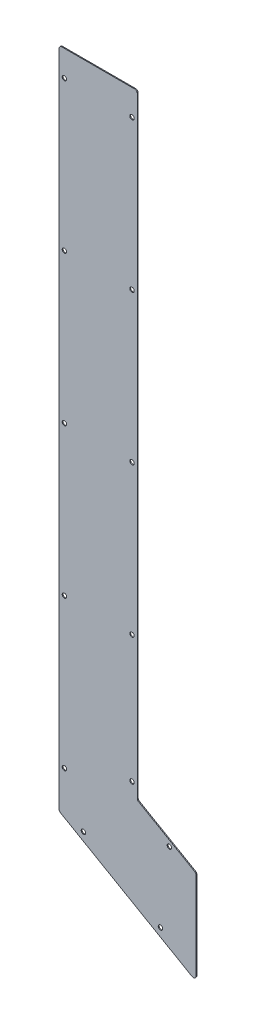
ISO-10303-21;
HEADER;
FILE_DESCRIPTION(('STEP AP214'),'2;1');
FILE_NAME('part.step','',(''),(''),'','','');
FILE_SCHEMA(('AUTOMOTIVE_DESIGN { 1 0 10303 214 1 1 1 1 }'));
ENDSEC;
DATA;
#1=APPLICATION_CONTEXT('core data for automotive mechanical design processes');
#2=APPLICATION_PROTOCOL_DEFINITION('international standard','automotive_design',2000,#1);
#3=PRODUCT_CONTEXT('',#1,'mechanical');
#4=PRODUCT('Part','Part','',(#3));
#5=PRODUCT_RELATED_PRODUCT_CATEGORY('part','',(#4));
#6=PRODUCT_DEFINITION_FORMATION('','',#4);
#7=PRODUCT_DEFINITION_CONTEXT('part definition',#1,'design');
#8=PRODUCT_DEFINITION('design','',#6,#7);
#9=PRODUCT_DEFINITION_SHAPE('','',#8);
#10=(LENGTH_UNIT() NAMED_UNIT(*) SI_UNIT(.MILLI.,.METRE.));
#11=(NAMED_UNIT(*) PLANE_ANGLE_UNIT() SI_UNIT($,.RADIAN.));
#12=(NAMED_UNIT(*) SI_UNIT($,.STERADIAN.) SOLID_ANGLE_UNIT());
#13=UNCERTAINTY_MEASURE_WITH_UNIT(LENGTH_MEASURE(1.E-05),#10,'distance_accuracy_value','');
#14=(GEOMETRIC_REPRESENTATION_CONTEXT(3) GLOBAL_UNCERTAINTY_ASSIGNED_CONTEXT((#13)) GLOBAL_UNIT_ASSIGNED_CONTEXT((#10,
#11,#12)) REPRESENTATION_CONTEXT('',''));
#15=CARTESIAN_POINT('',(0.,0.,0.));
#16=DIRECTION('',(0.,0.,1.));
#17=DIRECTION('',(1.,0.,0.));
#18=AXIS2_PLACEMENT_3D('',#15,#16,#17);
#19=CARTESIAN_POINT('',(104.,161.74,-1.));
#20=DIRECTION('',(1.,0.,0.));
#21=DIRECTION('',(0.,0.,-1.));
#22=AXIS2_PLACEMENT_3D('',#19,#20,#21);
#23=PLANE('',#22);
#24=DIRECTION('',(0.,1.,0.));
#25=VECTOR('',#24,1.);
#26=CARTESIAN_POINT('',(104.,161.74,0.));
#27=LINE('',#26,#25);
#28=CARTESIAN_POINT('',(104.,163.472050807569,0.));
#29=VERTEX_POINT('',#28);
#30=CARTESIAN_POINT('',(104.,850.,0.));
#31=VERTEX_POINT('',#30);
#32=EDGE_CURVE('E202',#29,#31,#27,.T.);
#33=ORIENTED_EDGE('',*,*,#32,.F.);
#34=DIRECTION('',(0.,0.,1.));
#35=VECTOR('',#34,1.);
#36=CARTESIAN_POINT('',(104.,163.472050807569,-1.));
#37=LINE('',#36,#35);
#38=CARTESIAN_POINT('',(104.,163.472050807569,-1.));
#39=VERTEX_POINT('',#38);
#40=EDGE_CURVE('E195',#29,#39,#37,.F.);
#41=ORIENTED_EDGE('',*,*,#40,.T.);
#42=DIRECTION('',(0.,1.,0.));
#43=VECTOR('',#42,1.);
#44=CARTESIAN_POINT('',(104.,161.74,-1.));
#45=LINE('',#44,#43);
#46=CARTESIAN_POINT('',(104.,850.,-1.));
#47=VERTEX_POINT('',#46);
#48=EDGE_CURVE('E219',#39,#47,#45,.T.);
#49=ORIENTED_EDGE('',*,*,#48,.T.);
#50=DIRECTION('',(0.,0.,1.));
#51=VECTOR('',#50,1.);
#52=CARTESIAN_POINT('',(104.,850.,-1.));
#53=LINE('',#52,#51);
#54=EDGE_CURVE('E192',#47,#31,#53,.T.);
#55=ORIENTED_EDGE('',*,*,#54,.T.);
#56=EDGE_LOOP('',(#33,#41,#49,#55));
#57=FACE_BOUND('',#56,.T.);
#58=ADVANCED_FACE('F40',(#57),#23,.T.);
#59=CARTESIAN_POINT('',(104.,161.74,-1.));
#60=DIRECTION('',(0.500000000000004,0.866025403784436,0.));
#61=DIRECTION('',(-0.866025403784436,0.500000000000004,0.));
#62=AXIS2_PLACEMENT_3D('',#59,#60,#61);
#63=PLANE('',#62);
#64=DIRECTION('',(-0.866025403784436,0.500000000000004,0.));
#65=VECTOR('',#64,1.);
#66=CARTESIAN_POINT('',(104.,161.74,-1.));
#67=LINE('',#66,#65);
#68=CARTESIAN_POINT('',(168.5,124.500907637269,-1.));
#69=VERTEX_POINT('',#68);
#70=CARTESIAN_POINT('',(105.5,160.873974596216,-1.));
#71=VERTEX_POINT('',#70);
#72=EDGE_CURVE('E152',#69,#71,#67,.T.);
#73=ORIENTED_EDGE('',*,*,#72,.T.);
#74=DIRECTION('',(0.,0.,1.));
#75=VECTOR('',#74,1.);
#76=CARTESIAN_POINT('',(105.5,160.873974596216,0.));
#77=LINE('',#76,#75);
#78=CARTESIAN_POINT('',(105.5,160.873974596216,0.));
#79=VERTEX_POINT('',#78);
#80=EDGE_CURVE('E189',#71,#79,#77,.T.);
#81=ORIENTED_EDGE('',*,*,#80,.T.);
#82=DIRECTION('',(-0.866025403784436,0.500000000000004,0.));
#83=VECTOR('',#82,1.);
#84=CARTESIAN_POINT('',(104.,161.74,0.));
#85=LINE('',#84,#83);
#86=CARTESIAN_POINT('',(168.5,124.500907637269,0.));
#87=VERTEX_POINT('',#86);
#88=EDGE_CURVE('E204',#87,#79,#85,.T.);
#89=ORIENTED_EDGE('',*,*,#88,.F.);
#90=DIRECTION('',(0.,0.,1.));
#91=VECTOR('',#90,1.);
#92=CARTESIAN_POINT('',(168.5,124.500907637269,-1.));
#93=LINE('',#92,#91);
#94=EDGE_CURVE('E187',#87,#69,#93,.F.);
#95=ORIENTED_EDGE('',*,*,#94,.T.);
#96=EDGE_LOOP('',(#73,#81,#89,#95));
#97=FACE_BOUND('',#96,.T.);
#98=ADVANCED_FACE('F221',(#97),#63,.T.);
#99=CARTESIAN_POINT('',(170.,123.634882233484,-1.));
#100=DIRECTION('',(1.,0.,0.));
#101=DIRECTION('',(0.,0.,-1.));
#102=AXIS2_PLACEMENT_3D('',#99,#100,#101);
#103=PLANE('',#102);
#104=DIRECTION('',(0.,1.,0.));
#105=VECTOR('',#104,1.);
#106=CARTESIAN_POINT('',(170.,123.634882233484,0.));
#107=LINE('',#106,#105);
#108=CARTESIAN_POINT('',(170.,23.4361524227066,0.));
#109=VERTEX_POINT('',#108);
#110=CARTESIAN_POINT('',(170.,121.902831425915,0.));
#111=VERTEX_POINT('',#110);
#112=EDGE_CURVE('E244',#109,#111,#107,.T.);
#113=ORIENTED_EDGE('',*,*,#112,.F.);
#114=DIRECTION('',(0.,0.,1.));
#115=VECTOR('',#114,1.);
#116=CARTESIAN_POINT('',(170.,23.4361524227066,-1.));
#117=LINE('',#116,#115);
#118=CARTESIAN_POINT('',(170.,23.4361524227066,-1.));
#119=VERTEX_POINT('',#118);
#120=EDGE_CURVE('E185',#109,#119,#117,.F.);
#121=ORIENTED_EDGE('',*,*,#120,.T.);
#122=DIRECTION('',(0.,1.,0.));
#123=VECTOR('',#122,1.);
#124=CARTESIAN_POINT('',(170.,123.634882233484,-1.));
#125=LINE('',#124,#123);
#126=CARTESIAN_POINT('',(170.,121.902831425915,-1.));
#127=VERTEX_POINT('',#126);
#128=EDGE_CURVE('E156',#119,#127,#125,.T.);
#129=ORIENTED_EDGE('',*,*,#128,.T.);
#130=DIRECTION('',(0.,0.,1.));
#131=VECTOR('',#130,1.);
#132=CARTESIAN_POINT('',(170.,121.902831425915,-1.));
#133=LINE('',#132,#131);
#134=EDGE_CURVE('E182',#127,#111,#133,.T.);
#135=ORIENTED_EDGE('',*,*,#134,.T.);
#136=EDGE_LOOP('',(#113,#121,#129,#135));
#137=FACE_BOUND('',#136,.T.);
#138=ADVANCED_FACE('F231',(#137),#103,.T.);
#139=CARTESIAN_POINT('',(170.,18.2399999999999,-1.));
#140=DIRECTION('',(-0.500000000000004,-0.866025403784436,0.));
#141=DIRECTION('',(0.866025403784436,-0.500000000000004,0.));
#142=AXIS2_PLACEMENT_3D('',#139,#140,#141);
#143=PLANE('',#142);
#144=DIRECTION('',(0.866025403784436,-0.500000000000004,0.));
#145=VECTOR('',#144,1.);
#146=CARTESIAN_POINT('',(170.,18.2399999999999,0.));
#147=LINE('',#146,#145);
#148=CARTESIAN_POINT('',(17.5000000000001,106.285916051419,0.));
#149=VERTEX_POINT('',#148);
#150=CARTESIAN_POINT('',(165.5,20.8380762113533,0.));
#151=VERTEX_POINT('',#150);
#152=EDGE_CURVE('E149',#149,#151,#147,.T.);
#153=ORIENTED_EDGE('',*,*,#152,.F.);
#154=DIRECTION('',(0.,0.,1.));
#155=VECTOR('',#154,1.);
#156=CARTESIAN_POINT('',(17.5000000000001,106.285916051419,-1.));
#157=LINE('',#156,#155);
#158=CARTESIAN_POINT('',(17.5000000000001,106.285916051419,-1.));
#159=VERTEX_POINT('',#158);
#160=EDGE_CURVE('E171',#149,#159,#157,.F.);
#161=ORIENTED_EDGE('',*,*,#160,.T.);
#162=DIRECTION('',(0.866025403784436,-0.500000000000004,0.));
#163=VECTOR('',#162,1.);
#164=CARTESIAN_POINT('',(170.,18.2399999999999,-1.));
#165=LINE('',#164,#163);
#166=CARTESIAN_POINT('',(165.5,20.8380762113533,-1.));
#167=VERTEX_POINT('',#166);
#168=EDGE_CURVE('E234',#159,#167,#165,.T.);
#169=ORIENTED_EDGE('',*,*,#168,.T.);
#170=DIRECTION('',(0.,0.,1.));
#171=VECTOR('',#170,1.);
#172=CARTESIAN_POINT('',(165.5,20.8380762113533,-1.));
#173=LINE('',#172,#171);
#174=EDGE_CURVE('E168',#167,#151,#173,.T.);
#175=ORIENTED_EDGE('',*,*,#174,.T.);
#176=EDGE_LOOP('',(#153,#161,#169,#175));
#177=FACE_BOUND('',#176,.T.);
#178=ADVANCED_FACE('F339',(#177),#143,.T.);
#179=CARTESIAN_POINT('',(16.,853.,-1.));
#180=DIRECTION('',(-1.,0.,0.));
#181=DIRECTION('',(0.,-1.,0.));
#182=AXIS2_PLACEMENT_3D('',#179,#180,#181);
#183=PLANE('',#182);
#184=DIRECTION('',(0.,-1.,0.));
#185=VECTOR('',#184,1.);
#186=CARTESIAN_POINT('',(16.,853.,-1.));
#187=LINE('',#186,#185);
#188=CARTESIAN_POINT('',(16.,850.,-1.));
#189=VERTEX_POINT('',#188);
#190=CARTESIAN_POINT('',(16.0000000000001,108.883992262772,-1.));
#191=VERTEX_POINT('',#190);
#192=EDGE_CURVE('E237',#189,#191,#187,.T.);
#193=ORIENTED_EDGE('',*,*,#192,.T.);
#194=DIRECTION('',(0.,0.,1.));
#195=VECTOR('',#194,1.);
#196=CARTESIAN_POINT('',(16.0000000000001,108.883992262772,-1.));
#197=LINE('',#196,#195);
#198=CARTESIAN_POINT('',(16.0000000000001,108.883992262772,0.));
#199=VERTEX_POINT('',#198);
#200=EDGE_CURVE('E148',#191,#199,#197,.T.);
#201=ORIENTED_EDGE('',*,*,#200,.T.);
#202=DIRECTION('',(0.,-1.,0.));
#203=VECTOR('',#202,1.);
#204=CARTESIAN_POINT('',(16.,853.,0.));
#205=LINE('',#204,#203);
#206=CARTESIAN_POINT('',(16.,850.,0.));
#207=VERTEX_POINT('',#206);
#208=EDGE_CURVE('E133',#207,#199,#205,.T.);
#209=ORIENTED_EDGE('',*,*,#208,.F.);
#210=DIRECTION('',(0.,0.,1.));
#211=VECTOR('',#210,1.);
#212=CARTESIAN_POINT('',(16.,850.,-1.));
#213=LINE('',#212,#211);
#214=EDGE_CURVE('E146',#207,#189,#213,.F.);
#215=ORIENTED_EDGE('',*,*,#214,.T.);
#216=EDGE_LOOP('',(#193,#201,#209,#215));
#217=FACE_BOUND('',#216,.T.);
#218=ADVANCED_FACE('F145',(#217),#183,.T.);
#219=CARTESIAN_POINT('',(104.,853.,-1.));
#220=DIRECTION('',(0.,1.,0.));
#221=DIRECTION('',(0.,0.,1.));
#222=AXIS2_PLACEMENT_3D('',#219,#220,#221);
#223=PLANE('',#222);
#224=DIRECTION('',(-1.,0.,0.));
#225=VECTOR('',#224,1.);
#226=CARTESIAN_POINT('',(104.,853.,-1.));
#227=LINE('',#226,#225);
#228=CARTESIAN_POINT('',(101.,853.,-1.));
#229=VERTEX_POINT('',#228);
#230=CARTESIAN_POINT('',(19.,853.,-1.));
#231=VERTEX_POINT('',#230);
#232=EDGE_CURVE('E332',#229,#231,#227,.T.);
#233=ORIENTED_EDGE('',*,*,#232,.T.);
#234=DIRECTION('',(0.,0.,1.));
#235=VECTOR('',#234,1.);
#236=CARTESIAN_POINT('',(19.,853.,-1.));
#237=LINE('',#236,#235);
#238=CARTESIAN_POINT('',(19.,853.,0.));
#239=VERTEX_POINT('',#238);
#240=EDGE_CURVE('E198',#231,#239,#237,.T.);
#241=ORIENTED_EDGE('',*,*,#240,.T.);
#242=DIRECTION('',(-1.,0.,0.));
#243=VECTOR('',#242,1.);
#244=CARTESIAN_POINT('',(104.,853.,0.));
#245=LINE('',#244,#243);
#246=CARTESIAN_POINT('',(101.,853.,0.));
#247=VERTEX_POINT('',#246);
#248=EDGE_CURVE('E134',#247,#239,#245,.T.);
#249=ORIENTED_EDGE('',*,*,#248,.F.);
#250=DIRECTION('',(0.,0.,1.));
#251=VECTOR('',#250,1.);
#252=CARTESIAN_POINT('',(101.,853.,-1.));
#253=LINE('',#252,#251);
#254=EDGE_CURVE('E62',#247,#229,#253,.F.);
#255=ORIENTED_EDGE('',*,*,#254,.T.);
#256=EDGE_LOOP('',(#233,#241,#249,#255));
#257=FACE_BOUND('',#256,.T.);
#258=ADVANCED_FACE('F358',(#257),#223,.T.);
#259=CARTESIAN_POINT('',(0.,0.,-1.));
#260=DIRECTION('',(0.,0.,1.));
#261=DIRECTION('',(1.,0.,0.));
#262=AXIS2_PLACEMENT_3D('',#259,#260,#261);
#263=PLANE('',#262);
#264=CARTESIAN_POINT('',(21.9999999999822,488.,-1.));
#265=DIRECTION('',(0.,0.,-1.));
#266=DIRECTION('',(-1.,0.,0.));
#267=AXIS2_PLACEMENT_3D('',#264,#265,#266);
#268=CIRCLE('',#267,2.5);
#269=CARTESIAN_POINT('',(19.4999999999822,488.,-1.));
#270=VERTEX_POINT('',#269);
#271=EDGE_CURVE('E420',#270,#270,#268,.T.);
#272=ORIENTED_EDGE('',*,*,#271,.F.);
#273=EDGE_LOOP('',(#272));
#274=FACE_BOUND('',#273,.T.);
#275=CARTESIAN_POINT('',(21.9999999999911,656.,-1.));
#276=DIRECTION('',(0.,0.,-1.));
#277=DIRECTION('',(-1.,0.,0.));
#278=AXIS2_PLACEMENT_3D('',#275,#276,#277);
#279=CIRCLE('',#278,2.5);
#280=CARTESIAN_POINT('',(19.4999999999911,656.,-1.));
#281=VERTEX_POINT('',#280);
#282=EDGE_CURVE('E424',#281,#281,#279,.T.);
#283=ORIENTED_EDGE('',*,*,#282,.F.);
#284=EDGE_LOOP('',(#283));
#285=FACE_BOUND('',#284,.T.);
#286=CARTESIAN_POINT('',(140.,134.564882233484,-1.));
#287=DIRECTION('',(0.,0.,-1.));
#288=DIRECTION('',(-1.,0.,0.));
#289=AXIS2_PLACEMENT_3D('',#286,#287,#288);
#290=CIRCLE('',#289,2.5);
#291=CARTESIAN_POINT('',(137.5,134.564882233484,-1.));
#292=VERTEX_POINT('',#291);
#293=EDGE_CURVE('E439',#292,#292,#290,.T.);
#294=ORIENTED_EDGE('',*,*,#293,.F.);
#295=EDGE_LOOP('',(#294));
#296=FACE_BOUND('',#295,.T.);
#297=CARTESIAN_POINT('',(97.9999999999661,319.999999999996,-1.));
#298=DIRECTION('',(0.,0.,-1.));
#299=DIRECTION('',(-1.,0.,0.));
#300=AXIS2_PLACEMENT_3D('',#297,#298,#299);
#301=CIRCLE('',#300,2.50000000000001);
#302=CARTESIAN_POINT('',(95.4999999999661,319.999999999996,-1.));
#303=VERTEX_POINT('',#302);
#304=EDGE_CURVE('E435',#303,#303,#301,.T.);
#305=ORIENTED_EDGE('',*,*,#304,.F.);
#306=EDGE_LOOP('',(#305));
#307=FACE_BOUND('',#306,.T.);
#308=CARTESIAN_POINT('',(97.9999999999661,177.,-1.));
#309=DIRECTION('',(0.,0.,-1.));
#310=DIRECTION('',(-1.,0.,0.));
#311=AXIS2_PLACEMENT_3D('',#308,#309,#310);
#312=CIRCLE('',#311,2.50000000000001);
#313=CARTESIAN_POINT('',(95.4999999999661,177.,-1.));
#314=VERTEX_POINT('',#313);
#315=EDGE_CURVE('E324',#314,#314,#312,.T.);
#316=ORIENTED_EDGE('',*,*,#315,.F.);
#317=EDGE_LOOP('',(#316));
#318=FACE_BOUND('',#317,.T.);
#319=CARTESIAN_POINT('',(98.,823.999999999995,-1.));
#320=DIRECTION('',(0.,0.,-1.));
#321=DIRECTION('',(-1.,0.,0.));
#322=AXIS2_PLACEMENT_3D('',#319,#320,#321);
#323=CIRCLE('',#322,2.5);
#324=CARTESIAN_POINT('',(95.5,823.999999999995,-1.));
#325=VERTEX_POINT('',#324);
#326=EDGE_CURVE('E327',#325,#325,#323,.T.);
#327=ORIENTED_EDGE('',*,*,#326,.F.);
#328=EDGE_LOOP('',(#327));
#329=FACE_BOUND('',#328,.T.);
#330=CARTESIAN_POINT('',(97.9999999999887,655.999999999995,-1.));
#331=DIRECTION('',(0.,0.,-1.));
#332=DIRECTION('',(-1.,0.,0.));
#333=AXIS2_PLACEMENT_3D('',#330,#331,#332);
#334=CIRCLE('',#333,2.5);
#335=CARTESIAN_POINT('',(95.4999999999887,655.999999999995,-1.));
#336=VERTEX_POINT('',#335);
#337=EDGE_CURVE('E444',#336,#336,#334,.T.);
#338=ORIENTED_EDGE('',*,*,#337,.F.);
#339=EDGE_LOOP('',(#338));
#340=FACE_BOUND('',#339,.T.);
#341=CARTESIAN_POINT('',(97.9999999999774,487.999999999995,-1.));
#342=DIRECTION('',(0.,0.,-1.));
#343=DIRECTION('',(-1.,0.,0.));
#344=AXIS2_PLACEMENT_3D('',#341,#342,#343);
#345=CIRCLE('',#344,2.5);
#346=CARTESIAN_POINT('',(95.4999999999774,487.999999999995,-1.));
#347=VERTEX_POINT('',#346);
#348=EDGE_CURVE('E438',#347,#347,#345,.T.);
#349=ORIENTED_EDGE('',*,*,#348,.F.);
#350=EDGE_LOOP('',(#349));
#351=FACE_BOUND('',#350,.T.);
#352=CARTESIAN_POINT('',(21.9999999999732,320.,-1.));
#353=DIRECTION('',(0.,0.,-1.));
#354=DIRECTION('',(-1.,0.,0.));
#355=AXIS2_PLACEMENT_3D('',#352,#353,#354);
#356=CIRCLE('',#355,2.5);
#357=CARTESIAN_POINT('',(19.4999999999732,320.,-1.));
#358=VERTEX_POINT('',#357);
#359=EDGE_CURVE('E418',#358,#358,#356,.T.);
#360=ORIENTED_EDGE('',*,*,#359,.F.);
#361=EDGE_LOOP('',(#360));
#362=FACE_BOUND('',#361,.T.);
#363=CARTESIAN_POINT('',(21.9999999999548,152.,-1.));
#364=DIRECTION('',(0.,0.,-1.));
#365=DIRECTION('',(-1.,0.,0.));
#366=AXIS2_PLACEMENT_3D('',#363,#364,#365);
#367=CIRCLE('',#366,2.5);
#368=CARTESIAN_POINT('',(19.4999999999548,152.,-1.));
#369=VERTEX_POINT('',#368);
#370=EDGE_CURVE('E421',#369,#369,#367,.T.);
#371=ORIENTED_EDGE('',*,*,#370,.F.);
#372=EDGE_LOOP('',(#371));
#373=FACE_BOUND('',#372,.T.);
#374=CARTESIAN_POINT('',(130.,50.7348822334842,-1.));
#375=DIRECTION('',(0.,0.,-1.));
#376=DIRECTION('',(-1.,0.,0.));
#377=AXIS2_PLACEMENT_3D('',#374,#375,#376);
#378=CIRCLE('',#377,2.5);
#379=CARTESIAN_POINT('',(127.5,50.7348822334842,-1.));
#380=VERTEX_POINT('',#379);
#381=EDGE_CURVE('E427',#380,#380,#378,.T.);
#382=ORIENTED_EDGE('',*,*,#381,.F.);
#383=EDGE_LOOP('',(#382));
#384=FACE_BOUND('',#383,.T.);
#385=CARTESIAN_POINT('',(43.3974596215561,100.734882233484,-1.));
#386=DIRECTION('',(0.,0.,-1.));
#387=DIRECTION('',(-1.,0.,0.));
#388=AXIS2_PLACEMENT_3D('',#385,#386,#387);
#389=CIRCLE('',#388,2.5);
#390=CARTESIAN_POINT('',(40.8974596215561,100.734882233484,-1.));
#391=VERTEX_POINT('',#390);
#392=EDGE_CURVE('E432',#391,#391,#389,.T.);
#393=ORIENTED_EDGE('',*,*,#392,.F.);
#394=EDGE_LOOP('',(#393));
#395=FACE_BOUND('',#394,.T.);
#396=CARTESIAN_POINT('',(22.,824.,-1.));
#397=DIRECTION('',(0.,0.,-1.));
#398=DIRECTION('',(-1.,0.,0.));
#399=AXIS2_PLACEMENT_3D('',#396,#397,#398);
#400=CIRCLE('',#399,2.5);
#401=CARTESIAN_POINT('',(19.5,824.,-1.));
#402=VERTEX_POINT('',#401);
#403=EDGE_CURVE('E251',#402,#402,#400,.T.);
#404=ORIENTED_EDGE('',*,*,#403,.F.);
#405=EDGE_LOOP('',(#404));
#406=FACE_BOUND('',#405,.T.);
#407=ORIENTED_EDGE('',*,*,#168,.F.);
#408=CARTESIAN_POINT('',(19.0000000000001,108.883992262772,-1.));
#409=DIRECTION('',(0.,0.,1.));
#410=DIRECTION('',(1.,0.,0.));
#411=AXIS2_PLACEMENT_3D('',#408,#409,#410);
#412=CIRCLE('',#411,3.);
#413=EDGE_CURVE('E180',#159,#191,#412,.F.);
#414=ORIENTED_EDGE('',*,*,#413,.T.);
#415=ORIENTED_EDGE('',*,*,#192,.F.);
#416=CARTESIAN_POINT('',(19.,850.,-1.));
#417=DIRECTION('',(0.,0.,1.));
#418=DIRECTION('',(1.,0.,0.));
#419=AXIS2_PLACEMENT_3D('',#416,#417,#418);
#420=CIRCLE('',#419,3.);
#421=EDGE_CURVE('E55',#189,#231,#420,.F.);
#422=ORIENTED_EDGE('',*,*,#421,.T.);
#423=ORIENTED_EDGE('',*,*,#232,.F.);
#424=CARTESIAN_POINT('',(101.,850.,-1.));
#425=DIRECTION('',(0.,0.,1.));
#426=DIRECTION('',(1.,0.,0.));
#427=AXIS2_PLACEMENT_3D('',#424,#425,#426);
#428=CIRCLE('',#427,3.);
#429=EDGE_CURVE('E173',#229,#47,#428,.F.);
#430=ORIENTED_EDGE('',*,*,#429,.T.);
#431=ORIENTED_EDGE('',*,*,#48,.F.);
#432=CARTESIAN_POINT('',(107.,163.472050807569,-1.));
#433=DIRECTION('',(0.,0.,1.));
#434=DIRECTION('',(1.,0.,0.));
#435=AXIS2_PLACEMENT_3D('',#432,#433,#434);
#436=CIRCLE('',#435,3.);
#437=EDGE_CURVE('E11',#39,#71,#436,.T.);
#438=ORIENTED_EDGE('',*,*,#437,.T.);
#439=ORIENTED_EDGE('',*,*,#72,.F.);
#440=CARTESIAN_POINT('',(167.,121.902831425915,-1.));
#441=DIRECTION('',(0.,0.,1.));
#442=DIRECTION('',(1.,0.,0.));
#443=AXIS2_PLACEMENT_3D('',#440,#441,#442);
#444=CIRCLE('',#443,3.);
#445=EDGE_CURVE('E176',#69,#127,#444,.F.);
#446=ORIENTED_EDGE('',*,*,#445,.T.);
#447=ORIENTED_EDGE('',*,*,#128,.F.);
#448=CARTESIAN_POINT('',(167.,23.4361524227066,-1.));
#449=DIRECTION('',(0.,0.,1.));
#450=DIRECTION('',(1.,0.,0.));
#451=AXIS2_PLACEMENT_3D('',#448,#449,#450);
#452=CIRCLE('',#451,3.);
#453=EDGE_CURVE('E178',#119,#167,#452,.F.);
#454=ORIENTED_EDGE('',*,*,#453,.T.);
#455=EDGE_LOOP('',(#407,#414,#415,#422,#423,#430,#431,#438,#439,#446,#447,#454));
#456=FACE_BOUND('',#455,.T.);
#457=ADVANCED_FACE('F217',(#274,#285,#296,#307,#318,#329,#340,#351,#362,#373,#384,#395,#406,
#456),#263,.F.);
#458=CARTESIAN_POINT('',(0.,0.,0.));
#459=DIRECTION('',(0.,0.,1.));
#460=DIRECTION('',(1.,0.,0.));
#461=AXIS2_PLACEMENT_3D('',#458,#459,#460);
#462=PLANE('',#461);
#463=CARTESIAN_POINT('',(21.9999999999822,488.,0.));
#464=DIRECTION('',(0.,0.,1.));
#465=DIRECTION('',(1.,0.,0.));
#466=AXIS2_PLACEMENT_3D('',#463,#464,#465);
#467=CIRCLE('',#466,2.5);
#468=CARTESIAN_POINT('',(24.4999999999822,488.,0.));
#469=VERTEX_POINT('',#468);
#470=EDGE_CURVE('E159',#469,#469,#467,.T.);
#471=ORIENTED_EDGE('',*,*,#470,.F.);
#472=EDGE_LOOP('',(#471));
#473=FACE_BOUND('',#472,.T.);
#474=CARTESIAN_POINT('',(21.9999999999911,656.,0.));
#475=DIRECTION('',(0.,0.,1.));
#476=DIRECTION('',(1.,0.,0.));
#477=AXIS2_PLACEMENT_3D('',#474,#475,#476);
#478=CIRCLE('',#477,2.5);
#479=CARTESIAN_POINT('',(24.4999999999911,656.,0.));
#480=VERTEX_POINT('',#479);
#481=EDGE_CURVE('E280',#480,#480,#478,.T.);
#482=ORIENTED_EDGE('',*,*,#481,.F.);
#483=EDGE_LOOP('',(#482));
#484=FACE_BOUND('',#483,.T.);
#485=CARTESIAN_POINT('',(140.,134.564882233484,0.));
#486=DIRECTION('',(0.,0.,1.));
#487=DIRECTION('',(1.,0.,0.));
#488=AXIS2_PLACEMENT_3D('',#485,#486,#487);
#489=CIRCLE('',#488,2.5);
#490=CARTESIAN_POINT('',(142.5,134.564882233484,0.));
#491=VERTEX_POINT('',#490);
#492=EDGE_CURVE('E278',#491,#491,#489,.T.);
#493=ORIENTED_EDGE('',*,*,#492,.F.);
#494=EDGE_LOOP('',(#493));
#495=FACE_BOUND('',#494,.T.);
#496=CARTESIAN_POINT('',(97.9999999999661,319.999999999996,0.));
#497=DIRECTION('',(0.,0.,1.));
#498=DIRECTION('',(1.,0.,0.));
#499=AXIS2_PLACEMENT_3D('',#496,#497,#498);
#500=CIRCLE('',#499,2.50000000000001);
#501=CARTESIAN_POINT('',(100.499999999966,319.999999999996,0.));
#502=VERTEX_POINT('',#501);
#503=EDGE_CURVE('E275',#502,#502,#500,.T.);
#504=ORIENTED_EDGE('',*,*,#503,.F.);
#505=EDGE_LOOP('',(#504));
#506=FACE_BOUND('',#505,.T.);
#507=CARTESIAN_POINT('',(97.9999999999661,177.,0.));
#508=DIRECTION('',(0.,0.,1.));
#509=DIRECTION('',(1.,0.,0.));
#510=AXIS2_PLACEMENT_3D('',#507,#508,#509);
#511=CIRCLE('',#510,2.50000000000001);
#512=CARTESIAN_POINT('',(100.499999999966,177.,0.));
#513=VERTEX_POINT('',#512);
#514=EDGE_CURVE('E272',#513,#513,#511,.T.);
#515=ORIENTED_EDGE('',*,*,#514,.F.);
#516=EDGE_LOOP('',(#515));
#517=FACE_BOUND('',#516,.T.);
#518=CARTESIAN_POINT('',(98.,823.999999999995,0.));
#519=DIRECTION('',(0.,0.,1.));
#520=DIRECTION('',(1.,0.,0.));
#521=AXIS2_PLACEMENT_3D('',#518,#519,#520);
#522=CIRCLE('',#521,2.5);
#523=CARTESIAN_POINT('',(100.5,823.999999999995,0.));
#524=VERTEX_POINT('',#523);
#525=EDGE_CURVE('E269',#524,#524,#522,.T.);
#526=ORIENTED_EDGE('',*,*,#525,.F.);
#527=EDGE_LOOP('',(#526));
#528=FACE_BOUND('',#527,.T.);
#529=CARTESIAN_POINT('',(97.9999999999887,655.999999999995,0.));
#530=DIRECTION('',(0.,0.,1.));
#531=DIRECTION('',(1.,0.,0.));
#532=AXIS2_PLACEMENT_3D('',#529,#530,#531);
#533=CIRCLE('',#532,2.5);
#534=CARTESIAN_POINT('',(100.499999999989,655.999999999995,0.));
#535=VERTEX_POINT('',#534);
#536=EDGE_CURVE('E266',#535,#535,#533,.T.);
#537=ORIENTED_EDGE('',*,*,#536,.F.);
#538=EDGE_LOOP('',(#537));
#539=FACE_BOUND('',#538,.T.);
#540=CARTESIAN_POINT('',(97.9999999999774,487.999999999995,0.));
#541=DIRECTION('',(0.,0.,1.));
#542=DIRECTION('',(1.,0.,0.));
#543=AXIS2_PLACEMENT_3D('',#540,#541,#542);
#544=CIRCLE('',#543,2.5);
#545=CARTESIAN_POINT('',(100.499999999977,487.999999999995,0.));
#546=VERTEX_POINT('',#545);
#547=EDGE_CURVE('E263',#546,#546,#544,.T.);
#548=ORIENTED_EDGE('',*,*,#547,.F.);
#549=EDGE_LOOP('',(#548));
#550=FACE_BOUND('',#549,.T.);
#551=CARTESIAN_POINT('',(21.9999999999732,320.,0.));
#552=DIRECTION('',(0.,0.,1.));
#553=DIRECTION('',(1.,0.,0.));
#554=AXIS2_PLACEMENT_3D('',#551,#552,#553);
#555=CIRCLE('',#554,2.5);
#556=CARTESIAN_POINT('',(24.4999999999732,320.,0.));
#557=VERTEX_POINT('',#556);
#558=EDGE_CURVE('E260',#557,#557,#555,.T.);
#559=ORIENTED_EDGE('',*,*,#558,.F.);
#560=EDGE_LOOP('',(#559));
#561=FACE_BOUND('',#560,.T.);
#562=CARTESIAN_POINT('',(21.9999999999548,152.,0.));
#563=DIRECTION('',(0.,0.,1.));
#564=DIRECTION('',(1.,0.,0.));
#565=AXIS2_PLACEMENT_3D('',#562,#563,#564);
#566=CIRCLE('',#565,2.5);
#567=CARTESIAN_POINT('',(24.4999999999548,152.,0.));
#568=VERTEX_POINT('',#567);
#569=EDGE_CURVE('E257',#568,#568,#566,.T.);
#570=ORIENTED_EDGE('',*,*,#569,.F.);
#571=EDGE_LOOP('',(#570));
#572=FACE_BOUND('',#571,.T.);
#573=CARTESIAN_POINT('',(130.,50.7348822334842,0.));
#574=DIRECTION('',(0.,0.,1.));
#575=DIRECTION('',(1.,0.,0.));
#576=AXIS2_PLACEMENT_3D('',#573,#574,#575);
#577=CIRCLE('',#576,2.5);
#578=CARTESIAN_POINT('',(132.5,50.7348822334842,0.));
#579=VERTEX_POINT('',#578);
#580=EDGE_CURVE('E254',#579,#579,#577,.T.);
#581=ORIENTED_EDGE('',*,*,#580,.F.);
#582=EDGE_LOOP('',(#581));
#583=FACE_BOUND('',#582,.T.);
#584=CARTESIAN_POINT('',(43.3974596215561,100.734882233484,0.));
#585=DIRECTION('',(0.,0.,1.));
#586=DIRECTION('',(1.,0.,0.));
#587=AXIS2_PLACEMENT_3D('',#584,#585,#586);
#588=CIRCLE('',#587,2.5);
#589=CARTESIAN_POINT('',(45.8974596215561,100.734882233484,0.));
#590=VERTEX_POINT('',#589);
#591=EDGE_CURVE('E250',#590,#590,#588,.T.);
#592=ORIENTED_EDGE('',*,*,#591,.F.);
#593=EDGE_LOOP('',(#592));
#594=FACE_BOUND('',#593,.T.);
#595=CARTESIAN_POINT('',(22.,824.,0.));
#596=DIRECTION('',(0.,0.,1.));
#597=DIRECTION('',(1.,0.,0.));
#598=AXIS2_PLACEMENT_3D('',#595,#596,#597);
#599=CIRCLE('',#598,2.5);
#600=CARTESIAN_POINT('',(24.5,824.,0.));
#601=VERTEX_POINT('',#600);
#602=EDGE_CURVE('E247',#601,#601,#599,.T.);
#603=ORIENTED_EDGE('',*,*,#602,.F.);
#604=EDGE_LOOP('',(#603));
#605=FACE_BOUND('',#604,.T.);
#606=ORIENTED_EDGE('',*,*,#208,.T.);
#607=CARTESIAN_POINT('',(19.0000000000001,108.883992262772,0.));
#608=DIRECTION('',(0.,0.,1.));
#609=DIRECTION('',(1.,0.,0.));
#610=AXIS2_PLACEMENT_3D('',#607,#608,#609);
#611=CIRCLE('',#610,3.);
#612=EDGE_CURVE('E166',#199,#149,#611,.T.);
#613=ORIENTED_EDGE('',*,*,#612,.T.);
#614=ORIENTED_EDGE('',*,*,#152,.T.);
#615=CARTESIAN_POINT('',(167.,23.4361524227066,0.));
#616=DIRECTION('',(0.,0.,1.));
#617=DIRECTION('',(1.,0.,0.));
#618=AXIS2_PLACEMENT_3D('',#615,#616,#617);
#619=CIRCLE('',#618,3.);
#620=EDGE_CURVE('E164',#151,#109,#619,.T.);
#621=ORIENTED_EDGE('',*,*,#620,.T.);
#622=ORIENTED_EDGE('',*,*,#112,.T.);
#623=CARTESIAN_POINT('',(167.,121.902831425915,0.));
#624=DIRECTION('',(0.,0.,1.));
#625=DIRECTION('',(1.,0.,0.));
#626=AXIS2_PLACEMENT_3D('',#623,#624,#625);
#627=CIRCLE('',#626,3.);
#628=EDGE_CURVE('E139',#111,#87,#627,.T.);
#629=ORIENTED_EDGE('',*,*,#628,.T.);
#630=ORIENTED_EDGE('',*,*,#88,.T.);
#631=CARTESIAN_POINT('',(107.,163.472050807569,0.));
#632=DIRECTION('',(0.,0.,1.));
#633=DIRECTION('',(1.,0.,0.));
#634=AXIS2_PLACEMENT_3D('',#631,#632,#633);
#635=CIRCLE('',#634,3.);
#636=EDGE_CURVE('E48',#79,#29,#635,.F.);
#637=ORIENTED_EDGE('',*,*,#636,.T.);
#638=ORIENTED_EDGE('',*,*,#32,.T.);
#639=CARTESIAN_POINT('',(101.,850.,0.));
#640=DIRECTION('',(0.,0.,1.));
#641=DIRECTION('',(1.,0.,0.));
#642=AXIS2_PLACEMENT_3D('',#639,#640,#641);
#643=CIRCLE('',#642,3.);
#644=EDGE_CURVE('E140',#31,#247,#643,.T.);
#645=ORIENTED_EDGE('',*,*,#644,.T.);
#646=ORIENTED_EDGE('',*,*,#248,.T.);
#647=CARTESIAN_POINT('',(19.,850.,0.));
#648=DIRECTION('',(0.,0.,1.));
#649=DIRECTION('',(1.,0.,0.));
#650=AXIS2_PLACEMENT_3D('',#647,#648,#649);
#651=CIRCLE('',#650,3.);
#652=EDGE_CURVE('E130',#239,#207,#651,.T.);
#653=ORIENTED_EDGE('',*,*,#652,.T.);
#654=EDGE_LOOP('',(#606,#613,#614,#621,#622,#629,#630,#637,#638,#645,#646,#653));
#655=FACE_BOUND('',#654,.T.);
#656=ADVANCED_FACE('F132',(#473,#484,#495,#506,#517,#528,#539,#550,#561,#572,#583,#594,#605,
#655),#462,.T.);
#657=CARTESIAN_POINT('',(22.,824.,9.));
#658=DIRECTION('',(0.,0.,-1.));
#659=DIRECTION('',(-1.,0.,0.));
#660=AXIS2_PLACEMENT_3D('',#657,#658,#659);
#661=CYLINDRICAL_SURFACE('',#660,2.5);
#662=ORIENTED_EDGE('',*,*,#602,.T.);
#663=EDGE_LOOP('',(#662));
#664=FACE_BOUND('',#663,.T.);
#665=ORIENTED_EDGE('',*,*,#403,.T.);
#666=EDGE_LOOP('',(#665));
#667=FACE_BOUND('',#666,.T.);
#668=ADVANCED_FACE('F292',(#664,#667),#661,.F.);
#669=CARTESIAN_POINT('',(43.3974596215561,100.734882233484,9.));
#670=DIRECTION('',(0.,0.,-1.));
#671=DIRECTION('',(-1.,0.,0.));
#672=AXIS2_PLACEMENT_3D('',#669,#670,#671);
#673=CYLINDRICAL_SURFACE('',#672,2.5);
#674=ORIENTED_EDGE('',*,*,#591,.T.);
#675=EDGE_LOOP('',(#674));
#676=FACE_BOUND('',#675,.T.);
#677=ORIENTED_EDGE('',*,*,#392,.T.);
#678=EDGE_LOOP('',(#677));
#679=FACE_BOUND('',#678,.T.);
#680=ADVANCED_FACE('F319',(#676,#679),#673,.F.);
#681=CARTESIAN_POINT('',(130.,50.7348822334842,9.));
#682=DIRECTION('',(0.,0.,-1.));
#683=DIRECTION('',(-1.,0.,0.));
#684=AXIS2_PLACEMENT_3D('',#681,#682,#683);
#685=CYLINDRICAL_SURFACE('',#684,2.5);
#686=ORIENTED_EDGE('',*,*,#580,.T.);
#687=EDGE_LOOP('',(#686));
#688=FACE_BOUND('',#687,.T.);
#689=ORIENTED_EDGE('',*,*,#381,.T.);
#690=EDGE_LOOP('',(#689));
#691=FACE_BOUND('',#690,.T.);
#692=ADVANCED_FACE('F402',(#688,#691),#685,.F.);
#693=CARTESIAN_POINT('',(21.9999999999548,152.,9.));
#694=DIRECTION('',(0.,0.,-1.));
#695=DIRECTION('',(-1.,0.,0.));
#696=AXIS2_PLACEMENT_3D('',#693,#694,#695);
#697=CYLINDRICAL_SURFACE('',#696,2.5);
#698=ORIENTED_EDGE('',*,*,#569,.T.);
#699=EDGE_LOOP('',(#698));
#700=FACE_BOUND('',#699,.T.);
#701=ORIENTED_EDGE('',*,*,#370,.T.);
#702=EDGE_LOOP('',(#701));
#703=FACE_BOUND('',#702,.T.);
#704=ADVANCED_FACE('F406',(#700,#703),#697,.F.);
#705=CARTESIAN_POINT('',(21.9999999999732,320.,9.));
#706=DIRECTION('',(0.,0.,-1.));
#707=DIRECTION('',(-1.,0.,0.));
#708=AXIS2_PLACEMENT_3D('',#705,#706,#707);
#709=CYLINDRICAL_SURFACE('',#708,2.5);
#710=ORIENTED_EDGE('',*,*,#558,.T.);
#711=EDGE_LOOP('',(#710));
#712=FACE_BOUND('',#711,.T.);
#713=ORIENTED_EDGE('',*,*,#359,.T.);
#714=EDGE_LOOP('',(#713));
#715=FACE_BOUND('',#714,.T.);
#716=ADVANCED_FACE('F383',(#712,#715),#709,.F.);
#717=CARTESIAN_POINT('',(97.9999999999774,487.999999999995,9.));
#718=DIRECTION('',(0.,0.,-1.));
#719=DIRECTION('',(-1.,0.,0.));
#720=AXIS2_PLACEMENT_3D('',#717,#718,#719);
#721=CYLINDRICAL_SURFACE('',#720,2.5);
#722=ORIENTED_EDGE('',*,*,#547,.T.);
#723=EDGE_LOOP('',(#722));
#724=FACE_BOUND('',#723,.T.);
#725=ORIENTED_EDGE('',*,*,#348,.T.);
#726=EDGE_LOOP('',(#725));
#727=FACE_BOUND('',#726,.T.);
#728=ADVANCED_FACE('F380',(#724,#727),#721,.F.);
#729=CARTESIAN_POINT('',(97.9999999999887,655.999999999995,9.));
#730=DIRECTION('',(0.,0.,-1.));
#731=DIRECTION('',(-1.,0.,0.));
#732=AXIS2_PLACEMENT_3D('',#729,#730,#731);
#733=CYLINDRICAL_SURFACE('',#732,2.5);
#734=ORIENTED_EDGE('',*,*,#536,.T.);
#735=EDGE_LOOP('',(#734));
#736=FACE_BOUND('',#735,.T.);
#737=ORIENTED_EDGE('',*,*,#337,.T.);
#738=EDGE_LOOP('',(#737));
#739=FACE_BOUND('',#738,.T.);
#740=ADVANCED_FACE('F374',(#736,#739),#733,.F.);
#741=CARTESIAN_POINT('',(98.,823.999999999995,9.));
#742=DIRECTION('',(0.,0.,-1.));
#743=DIRECTION('',(-1.,0.,0.));
#744=AXIS2_PLACEMENT_3D('',#741,#742,#743);
#745=CYLINDRICAL_SURFACE('',#744,2.5);
#746=ORIENTED_EDGE('',*,*,#525,.T.);
#747=EDGE_LOOP('',(#746));
#748=FACE_BOUND('',#747,.T.);
#749=ORIENTED_EDGE('',*,*,#326,.T.);
#750=EDGE_LOOP('',(#749));
#751=FACE_BOUND('',#750,.T.);
#752=ADVANCED_FACE('F370',(#748,#751),#745,.F.);
#753=CARTESIAN_POINT('',(97.9999999999661,177.,9.));
#754=DIRECTION('',(0.,0.,-1.));
#755=DIRECTION('',(-1.,0.,0.));
#756=AXIS2_PLACEMENT_3D('',#753,#754,#755);
#757=CYLINDRICAL_SURFACE('',#756,2.50000000000001);
#758=ORIENTED_EDGE('',*,*,#514,.T.);
#759=EDGE_LOOP('',(#758));
#760=FACE_BOUND('',#759,.T.);
#761=ORIENTED_EDGE('',*,*,#315,.T.);
#762=EDGE_LOOP('',(#761));
#763=FACE_BOUND('',#762,.T.);
#764=ADVANCED_FACE('F373',(#760,#763),#757,.F.);
#765=CARTESIAN_POINT('',(97.9999999999661,319.999999999996,9.));
#766=DIRECTION('',(0.,0.,-1.));
#767=DIRECTION('',(-1.,0.,0.));
#768=AXIS2_PLACEMENT_3D('',#765,#766,#767);
#769=CYLINDRICAL_SURFACE('',#768,2.50000000000001);
#770=ORIENTED_EDGE('',*,*,#503,.T.);
#771=EDGE_LOOP('',(#770));
#772=FACE_BOUND('',#771,.T.);
#773=ORIENTED_EDGE('',*,*,#304,.T.);
#774=EDGE_LOOP('',(#773));
#775=FACE_BOUND('',#774,.T.);
#776=ADVANCED_FACE('F378',(#772,#775),#769,.F.);
#777=CARTESIAN_POINT('',(140.,134.564882233484,9.));
#778=DIRECTION('',(0.,0.,-1.));
#779=DIRECTION('',(-1.,0.,0.));
#780=AXIS2_PLACEMENT_3D('',#777,#778,#779);
#781=CYLINDRICAL_SURFACE('',#780,2.5);
#782=ORIENTED_EDGE('',*,*,#492,.T.);
#783=EDGE_LOOP('',(#782));
#784=FACE_BOUND('',#783,.T.);
#785=ORIENTED_EDGE('',*,*,#293,.T.);
#786=EDGE_LOOP('',(#785));
#787=FACE_BOUND('',#786,.T.);
#788=ADVANCED_FACE('F393',(#784,#787),#781,.F.);
#789=CARTESIAN_POINT('',(21.9999999999911,656.,9.));
#790=DIRECTION('',(0.,0.,-1.));
#791=DIRECTION('',(-1.,0.,0.));
#792=AXIS2_PLACEMENT_3D('',#789,#790,#791);
#793=CYLINDRICAL_SURFACE('',#792,2.5);
#794=ORIENTED_EDGE('',*,*,#481,.T.);
#795=EDGE_LOOP('',(#794));
#796=FACE_BOUND('',#795,.T.);
#797=ORIENTED_EDGE('',*,*,#282,.T.);
#798=EDGE_LOOP('',(#797));
#799=FACE_BOUND('',#798,.T.);
#800=ADVANCED_FACE('F390',(#796,#799),#793,.F.);
#801=CARTESIAN_POINT('',(21.9999999999822,488.,9.));
#802=DIRECTION('',(0.,0.,-1.));
#803=DIRECTION('',(-1.,0.,0.));
#804=AXIS2_PLACEMENT_3D('',#801,#802,#803);
#805=CYLINDRICAL_SURFACE('',#804,2.5);
#806=ORIENTED_EDGE('',*,*,#470,.T.);
#807=EDGE_LOOP('',(#806));
#808=FACE_BOUND('',#807,.T.);
#809=ORIENTED_EDGE('',*,*,#271,.T.);
#810=EDGE_LOOP('',(#809));
#811=FACE_BOUND('',#810,.T.);
#812=ADVANCED_FACE('F287',(#808,#811),#805,.F.);
#813=CARTESIAN_POINT('',(19.0000000000001,108.883992262772,-1.));
#814=DIRECTION('',(0.,0.,1.));
#815=DIRECTION('',(1.,0.,0.));
#816=AXIS2_PLACEMENT_3D('',#813,#814,#815);
#817=CYLINDRICAL_SURFACE('',#816,3.);
#818=ORIENTED_EDGE('',*,*,#413,.F.);
#819=ORIENTED_EDGE('',*,*,#160,.F.);
#820=ORIENTED_EDGE('',*,*,#612,.F.);
#821=ORIENTED_EDGE('',*,*,#200,.F.);
#822=EDGE_LOOP('',(#818,#819,#820,#821));
#823=FACE_BOUND('',#822,.T.);
#824=ADVANCED_FACE('F335',(#823),#817,.T.);
#825=CARTESIAN_POINT('',(167.,23.4361524227066,-1.));
#826=DIRECTION('',(0.,0.,1.));
#827=DIRECTION('',(1.,0.,0.));
#828=AXIS2_PLACEMENT_3D('',#825,#826,#827);
#829=CYLINDRICAL_SURFACE('',#828,3.);
#830=ORIENTED_EDGE('',*,*,#453,.F.);
#831=ORIENTED_EDGE('',*,*,#120,.F.);
#832=ORIENTED_EDGE('',*,*,#620,.F.);
#833=ORIENTED_EDGE('',*,*,#174,.F.);
#834=EDGE_LOOP('',(#830,#831,#832,#833));
#835=FACE_BOUND('',#834,.T.);
#836=ADVANCED_FACE('F342',(#835),#829,.T.);
#837=CARTESIAN_POINT('',(107.,163.472050807569,-1.));
#838=DIRECTION('',(0.,0.,-1.));
#839=DIRECTION('',(-1.,0.,0.));
#840=AXIS2_PLACEMENT_3D('',#837,#838,#839);
#841=CYLINDRICAL_SURFACE('',#840,3.);
#842=ORIENTED_EDGE('',*,*,#437,.F.);
#843=ORIENTED_EDGE('',*,*,#40,.F.);
#844=ORIENTED_EDGE('',*,*,#636,.F.);
#845=ORIENTED_EDGE('',*,*,#80,.F.);
#846=EDGE_LOOP('',(#842,#843,#844,#845));
#847=FACE_BOUND('',#846,.T.);
#848=ADVANCED_FACE('F214',(#847),#841,.F.);
#849=CARTESIAN_POINT('',(167.,121.902831425915,-1.));
#850=DIRECTION('',(0.,0.,1.));
#851=DIRECTION('',(1.,0.,0.));
#852=AXIS2_PLACEMENT_3D('',#849,#850,#851);
#853=CYLINDRICAL_SURFACE('',#852,3.);
#854=ORIENTED_EDGE('',*,*,#445,.F.);
#855=ORIENTED_EDGE('',*,*,#94,.F.);
#856=ORIENTED_EDGE('',*,*,#628,.F.);
#857=ORIENTED_EDGE('',*,*,#134,.F.);
#858=EDGE_LOOP('',(#854,#855,#856,#857));
#859=FACE_BOUND('',#858,.T.);
#860=ADVANCED_FACE('F224',(#859),#853,.T.);
#861=CARTESIAN_POINT('',(19.,850.,-1.));
#862=DIRECTION('',(0.,0.,1.));
#863=DIRECTION('',(1.,0.,0.));
#864=AXIS2_PLACEMENT_3D('',#861,#862,#863);
#865=CYLINDRICAL_SURFACE('',#864,3.);
#866=ORIENTED_EDGE('',*,*,#421,.F.);
#867=ORIENTED_EDGE('',*,*,#214,.F.);
#868=ORIENTED_EDGE('',*,*,#652,.F.);
#869=ORIENTED_EDGE('',*,*,#240,.F.);
#870=EDGE_LOOP('',(#866,#867,#868,#869));
#871=FACE_BOUND('',#870,.T.);
#872=ADVANCED_FACE('F151',(#871),#865,.T.);
#873=CARTESIAN_POINT('',(101.,850.,-1.));
#874=DIRECTION('',(0.,0.,1.));
#875=DIRECTION('',(1.,0.,0.));
#876=AXIS2_PLACEMENT_3D('',#873,#874,#875);
#877=CYLINDRICAL_SURFACE('',#876,3.);
#878=ORIENTED_EDGE('',*,*,#429,.F.);
#879=ORIENTED_EDGE('',*,*,#254,.F.);
#880=ORIENTED_EDGE('',*,*,#644,.F.);
#881=ORIENTED_EDGE('',*,*,#54,.F.);
#882=EDGE_LOOP('',(#878,#879,#880,#881));
#883=FACE_BOUND('',#882,.T.);
#884=ADVANCED_FACE('F42',(#883),#877,.T.);
#885=CLOSED_SHELL('',(#58,#98,#138,#178,#218,#258,#457,#656,#668,#680,#692,#704,#716,#728,#740,
#752,#764,#776,#788,#800,#812,#824,#836,#848,#860,#872,#884));
#886=MANIFOLD_SOLID_BREP('B2',#885);
#887=ADVANCED_BREP_SHAPE_REPRESENTATION('',(#18,#886),#14);
#888=SHAPE_DEFINITION_REPRESENTATION(#9,#887);
ENDSEC;
END-ISO-10303-21;
